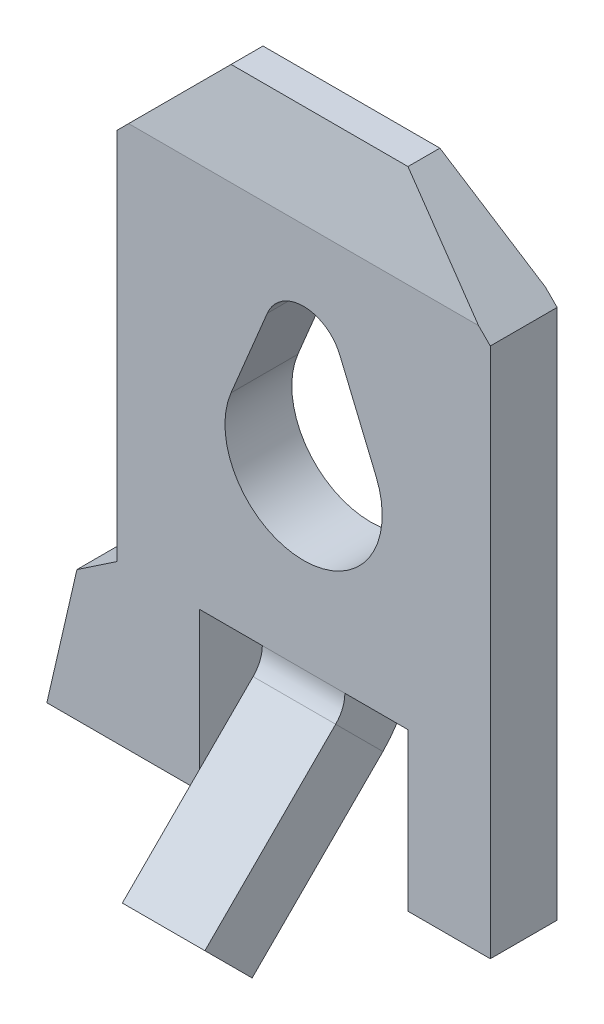
ISO-10303-21;
HEADER;
FILE_DESCRIPTION(('STEP AP214'),'2;1');
FILE_NAME('part.step','',(''),(''),'','','');
FILE_SCHEMA(('AUTOMOTIVE_DESIGN { 1 0 10303 214 1 1 1 1 }'));
ENDSEC;
DATA;
#1=APPLICATION_CONTEXT('core data for automotive mechanical design processes');
#2=APPLICATION_PROTOCOL_DEFINITION('international standard','automotive_design',2000,#1);
#3=PRODUCT_CONTEXT('',#1,'mechanical');
#4=PRODUCT('Part','Part','',(#3));
#5=PRODUCT_RELATED_PRODUCT_CATEGORY('part','',(#4));
#6=PRODUCT_DEFINITION_FORMATION('','',#4);
#7=PRODUCT_DEFINITION_CONTEXT('part definition',#1,'design');
#8=PRODUCT_DEFINITION('design','',#6,#7);
#9=PRODUCT_DEFINITION_SHAPE('','',#8);
#10=(LENGTH_UNIT() NAMED_UNIT(*) SI_UNIT(.MILLI.,.METRE.));
#11=(NAMED_UNIT(*) PLANE_ANGLE_UNIT() SI_UNIT($,.RADIAN.));
#12=(NAMED_UNIT(*) SI_UNIT($,.STERADIAN.) SOLID_ANGLE_UNIT());
#13=UNCERTAINTY_MEASURE_WITH_UNIT(LENGTH_MEASURE(1.E-05),#10,'distance_accuracy_value','');
#14=(GEOMETRIC_REPRESENTATION_CONTEXT(3) GLOBAL_UNCERTAINTY_ASSIGNED_CONTEXT((#13)) GLOBAL_UNIT_ASSIGNED_CONTEXT((#10,
#11,#12)) REPRESENTATION_CONTEXT('',''));
#15=CARTESIAN_POINT('',(0.,0.,0.));
#16=DIRECTION('',(0.,0.,1.));
#17=DIRECTION('',(1.,0.,0.));
#18=AXIS2_PLACEMENT_3D('',#15,#16,#17);
#19=CARTESIAN_POINT('',(4.75,0.149999999999999,0.));
#20=DIRECTION('',(0.,0.,1.));
#21=DIRECTION('',(0.,-1.,0.));
#22=AXIS2_PLACEMENT_3D('',#19,#20,#21);
#23=PLANE('',#22);
#24=DIRECTION('',(0.384813689288075,-0.922994271128755,0.));
#25=VECTOR('',#24,1.);
#26=CARTESIAN_POINT('',(2.84243697464802,5.82748992853653,0.));
#27=LINE('',#26,#25);
#28=CARTESIAN_POINT('',(2.84243697464802,5.82748992853653,0.));
#29=VERTEX_POINT('',#28);
#30=CARTESIAN_POINT('',(3.29799427112875,4.73481368928808,0.));
#31=VERTEX_POINT('',#30);
#32=EDGE_CURVE('E310',#29,#31,#27,.T.);
#33=ORIENTED_EDGE('',*,*,#32,.F.);
#34=CARTESIAN_POINT('',(2.375,5.65,0.));
#35=DIRECTION('',(0.,0.,1.));
#36=DIRECTION('',(0.,-1.,0.));
#37=AXIS2_PLACEMENT_3D('',#34,#35,#36);
#38=CIRCLE('',#37,0.5);
#39=CARTESIAN_POINT('',(1.91346153846154,5.84230769230769,0.));
#40=VERTEX_POINT('',#39);
#41=EDGE_CURVE('E313',#40,#29,#38,.F.);
#42=ORIENTED_EDGE('',*,*,#41,.F.);
#43=DIRECTION('',(0.384615384615385,0.923076923076923,0.));
#44=VECTOR('',#43,1.);
#45=CARTESIAN_POINT('',(1.91346153846154,5.84230769230769,0.));
#46=LINE('',#45,#44);
#47=CARTESIAN_POINT('',(1.45192307692308,4.73461538461538,0.));
#48=VERTEX_POINT('',#47);
#49=EDGE_CURVE('E315',#48,#40,#46,.T.);
#50=ORIENTED_EDGE('',*,*,#49,.F.);
#51=CARTESIAN_POINT('',(2.375,4.35,0.));
#52=DIRECTION('',(0.,0.,1.));
#53=DIRECTION('',(0.,-1.,0.));
#54=AXIS2_PLACEMENT_3D('',#51,#52,#53);
#55=CIRCLE('',#54,0.999999999999999);
#56=EDGE_CURVE('E307',#31,#48,#55,.F.);
#57=ORIENTED_EDGE('',*,*,#56,.F.);
#58=EDGE_LOOP('',(#33,#42,#50,#57));
#59=FACE_BOUND('',#58,.T.);
#60=DIRECTION('',(1.,0.,0.));
#61=VECTOR('',#60,1.);
#62=CARTESIAN_POINT('',(2.9,2.15,0.));
#63=LINE('',#62,#61);
#64=CARTESIAN_POINT('',(2.9,2.15,0.));
#65=VERTEX_POINT('',#64);
#66=CARTESIAN_POINT('',(3.7,2.15,0.));
#67=VERTEX_POINT('',#66);
#68=EDGE_CURVE('E274',#65,#67,#63,.T.);
#69=ORIENTED_EDGE('',*,*,#68,.F.);
#70=DIRECTION('',(-1.,0.,0.));
#71=VECTOR('',#70,1.);
#72=CARTESIAN_POINT('',(4.75,2.15,0.));
#73=LINE('',#72,#71);
#74=CARTESIAN_POINT('',(1.85000000000001,2.15,0.));
#75=VERTEX_POINT('',#74);
#76=EDGE_CURVE('E49',#65,#75,#73,.T.);
#77=ORIENTED_EDGE('',*,*,#76,.T.);
#78=DIRECTION('',(1.,0.,0.));
#79=VECTOR('',#78,1.);
#80=CARTESIAN_POINT('',(1.85,2.15,0.));
#81=LINE('',#80,#79);
#82=CARTESIAN_POINT('',(1.05,2.15,0.));
#83=VERTEX_POINT('',#82);
#84=EDGE_CURVE('E285',#83,#75,#81,.T.);
#85=ORIENTED_EDGE('',*,*,#84,.F.);
#86=DIRECTION('',(0.,1.,0.));
#87=VECTOR('',#86,1.);
#88=CARTESIAN_POINT('',(1.05,2.15,0.));
#89=LINE('',#88,#87);
#90=CARTESIAN_POINT('',(1.05,0.149999999999999,0.));
#91=VERTEX_POINT('',#90);
#92=EDGE_CURVE('E282',#91,#83,#89,.T.);
#93=ORIENTED_EDGE('',*,*,#92,.F.);
#94=DIRECTION('',(-1.,0.,0.));
#95=VECTOR('',#94,1.);
#96=CARTESIAN_POINT('',(4.75,0.149999999999999,0.));
#97=LINE('',#96,#95);
#98=CARTESIAN_POINT('',(-0.890356386047537,0.149999999999998,0.));
#99=VERTEX_POINT('',#98);
#100=EDGE_CURVE('E379',#91,#99,#97,.T.);
#101=ORIENTED_EDGE('',*,*,#100,.T.);
#102=DIRECTION('',(0.224692209858573,0.974429787531596,0.));
#103=VECTOR('',#102,1.);
#104=CARTESIAN_POINT('',(-0.507898340442458,1.80861785930754,0.));
#105=LINE('',#104,#103);
#106=CARTESIAN_POINT('',(-0.507898340442458,1.80861785930754,0.));
#107=VERTEX_POINT('',#106);
#108=EDGE_CURVE('E228',#99,#107,#105,.T.);
#109=ORIENTED_EDGE('',*,*,#108,.T.);
#110=DIRECTION('',(0.829945240760083,0.557844868525011,0.));
#111=VECTOR('',#110,1.);
#112=CARTESIAN_POINT('',(0.,2.15,0.));
#113=LINE('',#112,#111);
#114=CARTESIAN_POINT('',(0.,2.15,0.));
#115=VERTEX_POINT('',#114);
#116=EDGE_CURVE('E206',#107,#115,#113,.T.);
#117=ORIENTED_EDGE('',*,*,#116,.T.);
#118=DIRECTION('',(0.,1.,0.));
#119=VECTOR('',#118,1.);
#120=CARTESIAN_POINT('',(0.,0.149999999999999,0.));
#121=LINE('',#120,#119);
#122=CARTESIAN_POINT('',(0.,6.9,0.));
#123=VERTEX_POINT('',#122);
#124=EDGE_CURVE('E369',#115,#123,#121,.T.);
#125=ORIENTED_EDGE('',*,*,#124,.T.);
#126=DIRECTION('',(-0.707106781186548,-0.707106781186548,0.));
#127=VECTOR('',#126,1.);
#128=CARTESIAN_POINT('',(0.,6.9,0.));
#129=LINE('',#128,#127);
#130=CARTESIAN_POINT('',(0.15,7.05,0.));
#131=VERTEX_POINT('',#130);
#132=EDGE_CURVE('E343',#131,#123,#129,.T.);
#133=ORIENTED_EDGE('',*,*,#132,.F.);
#134=DIRECTION('',(-1.,0.,0.));
#135=VECTOR('',#134,1.);
#136=CARTESIAN_POINT('',(4.75,7.05,0.));
#137=LINE('',#136,#135);
#138=CARTESIAN_POINT('',(4.6,7.05,0.));
#139=VERTEX_POINT('',#138);
#140=EDGE_CURVE('E374',#139,#131,#137,.T.);
#141=ORIENTED_EDGE('',*,*,#140,.F.);
#142=DIRECTION('',(-0.707106781186548,0.707106781186548,0.));
#143=VECTOR('',#142,1.);
#144=CARTESIAN_POINT('',(3.5,8.15,0.));
#145=LINE('',#144,#143);
#146=CARTESIAN_POINT('',(4.75,6.9,0.));
#147=VERTEX_POINT('',#146);
#148=EDGE_CURVE('E339',#147,#139,#145,.T.);
#149=ORIENTED_EDGE('',*,*,#148,.F.);
#150=DIRECTION('',(0.,1.,0.));
#151=VECTOR('',#150,1.);
#152=CARTESIAN_POINT('',(4.75,0.149999999999999,0.));
#153=LINE('',#152,#151);
#154=CARTESIAN_POINT('',(4.75,0.149999999999999,0.));
#155=VERTEX_POINT('',#154);
#156=EDGE_CURVE('E371',#155,#147,#153,.T.);
#157=ORIENTED_EDGE('',*,*,#156,.F.);
#158=CARTESIAN_POINT('',(3.7,0.149999999999999,0.));
#159=VERTEX_POINT('',#158);
#160=EDGE_CURVE('E380',#155,#159,#97,.T.);
#161=ORIENTED_EDGE('',*,*,#160,.T.);
#162=DIRECTION('',(0.,-1.,0.));
#163=VECTOR('',#162,1.);
#164=CARTESIAN_POINT('',(3.7,2.15,0.));
#165=LINE('',#164,#163);
#166=EDGE_CURVE('E299',#67,#159,#165,.T.);
#167=ORIENTED_EDGE('',*,*,#166,.F.);
#168=EDGE_LOOP('',(#69,#77,#85,#93,#101,#109,#117,#125,#133,#141,#149,#157,#161,#167));
#169=FACE_BOUND('',#168,.T.);
#170=ADVANCED_FACE('F42',(#59,#169),#23,.F.);
#171=CARTESIAN_POINT('',(4.75,7.05,0.85));
#172=DIRECTION('',(0.,0.,-1.));
#173=DIRECTION('',(0.,1.,0.));
#174=AXIS2_PLACEMENT_3D('',#171,#172,#173);
#175=PLANE('',#174);
#176=DIRECTION('',(-0.384615384615385,-0.923076923076923,0.));
#177=VECTOR('',#176,1.);
#178=CARTESIAN_POINT('',(1.91346153846154,5.84230769230769,0.849999999999999));
#179=LINE('',#178,#177);
#180=CARTESIAN_POINT('',(1.91346153846154,5.84230769230769,0.85));
#181=VERTEX_POINT('',#180);
#182=CARTESIAN_POINT('',(1.45192307692308,4.73461538461538,0.849999999999999));
#183=VERTEX_POINT('',#182);
#184=EDGE_CURVE('E317',#181,#183,#179,.T.);
#185=ORIENTED_EDGE('',*,*,#184,.F.);
#186=CARTESIAN_POINT('',(2.375,5.65,0.849999999999999));
#187=DIRECTION('',(0.,0.,1.));
#188=DIRECTION('',(1.,0.,0.));
#189=AXIS2_PLACEMENT_3D('',#186,#187,#188);
#190=CIRCLE('',#189,0.5);
#191=CARTESIAN_POINT('',(2.84243697464802,5.82748992853653,0.849999999999999));
#192=VERTEX_POINT('',#191);
#193=EDGE_CURVE('E293',#192,#181,#190,.T.);
#194=ORIENTED_EDGE('',*,*,#193,.F.);
#195=DIRECTION('',(-0.384813689288075,0.922994271128755,0.));
#196=VECTOR('',#195,1.);
#197=CARTESIAN_POINT('',(2.84243697464802,5.82748992853653,0.849999999999999));
#198=LINE('',#197,#196);
#199=CARTESIAN_POINT('',(3.29799427112875,4.73481368928808,0.849999999999999));
#200=VERTEX_POINT('',#199);
#201=EDGE_CURVE('E323',#200,#192,#198,.T.);
#202=ORIENTED_EDGE('',*,*,#201,.F.);
#203=CARTESIAN_POINT('',(2.375,4.35,0.849999999999999));
#204=DIRECTION('',(0.,0.,1.));
#205=DIRECTION('',(1.,0.,0.));
#206=AXIS2_PLACEMENT_3D('',#203,#204,#205);
#207=CIRCLE('',#206,0.999999999999999);
#208=EDGE_CURVE('E320',#183,#200,#207,.T.);
#209=ORIENTED_EDGE('',*,*,#208,.F.);
#210=EDGE_LOOP('',(#185,#194,#202,#209));
#211=FACE_BOUND('',#210,.T.);
#212=DIRECTION('',(-1.,0.,0.));
#213=VECTOR('',#212,1.);
#214=CARTESIAN_POINT('',(1.85,2.15,0.85));
#215=LINE('',#214,#213);
#216=CARTESIAN_POINT('',(1.85000000000001,2.15,0.849999999999999));
#217=VERTEX_POINT('',#216);
#218=CARTESIAN_POINT('',(1.05,2.15,0.85));
#219=VERTEX_POINT('',#218);
#220=EDGE_CURVE('E278',#217,#219,#215,.T.);
#221=ORIENTED_EDGE('',*,*,#220,.F.);
#222=DIRECTION('',(1.,0.,0.));
#223=VECTOR('',#222,1.);
#224=CARTESIAN_POINT('',(4.75,2.15,0.849999999999999));
#225=LINE('',#224,#223);
#226=CARTESIAN_POINT('',(2.9,2.15,0.849999999999999));
#227=VERTEX_POINT('',#226);
#228=EDGE_CURVE('E396',#217,#227,#225,.T.);
#229=ORIENTED_EDGE('',*,*,#228,.T.);
#230=DIRECTION('',(-1.,0.,0.));
#231=VECTOR('',#230,1.);
#232=CARTESIAN_POINT('',(2.9,2.15,0.85));
#233=LINE('',#232,#231);
#234=CARTESIAN_POINT('',(3.7,2.15,0.85));
#235=VERTEX_POINT('',#234);
#236=EDGE_CURVE('E286',#235,#227,#233,.T.);
#237=ORIENTED_EDGE('',*,*,#236,.F.);
#238=DIRECTION('',(0.,1.,0.));
#239=VECTOR('',#238,1.);
#240=CARTESIAN_POINT('',(3.7,2.15,0.85));
#241=LINE('',#240,#239);
#242=CARTESIAN_POINT('',(3.7,0.149999999999999,0.849999999999999));
#243=VERTEX_POINT('',#242);
#244=EDGE_CURVE('E294',#243,#235,#241,.T.);
#245=ORIENTED_EDGE('',*,*,#244,.F.);
#246=DIRECTION('',(-1.,0.,0.));
#247=VECTOR('',#246,1.);
#248=CARTESIAN_POINT('',(4.75,0.149999999999999,0.849999999999999));
#249=LINE('',#248,#247);
#250=CARTESIAN_POINT('',(4.75,0.149999999999999,0.849999999999999));
#251=VERTEX_POINT('',#250);
#252=EDGE_CURVE('E384',#251,#243,#249,.T.);
#253=ORIENTED_EDGE('',*,*,#252,.F.);
#254=DIRECTION('',(0.,-1.,0.));
#255=VECTOR('',#254,1.);
#256=CARTESIAN_POINT('',(4.75,7.05,0.85));
#257=LINE('',#256,#255);
#258=CARTESIAN_POINT('',(4.75,6.9,0.85));
#259=VERTEX_POINT('',#258);
#260=EDGE_CURVE('E366',#259,#251,#257,.T.);
#261=ORIENTED_EDGE('',*,*,#260,.F.);
#262=DIRECTION('',(0.707106781186548,-0.707106781186548,0.));
#263=VECTOR('',#262,1.);
#264=CARTESIAN_POINT('',(3.5,8.15,0.849999999999999));
#265=LINE('',#264,#263);
#266=CARTESIAN_POINT('',(4.6,7.05,0.849999999999999));
#267=VERTEX_POINT('',#266);
#268=EDGE_CURVE('E335',#267,#259,#265,.T.);
#269=ORIENTED_EDGE('',*,*,#268,.F.);
#270=DIRECTION('',(-1.,0.,0.));
#271=VECTOR('',#270,1.);
#272=CARTESIAN_POINT('',(4.75,7.05,0.85));
#273=LINE('',#272,#271);
#274=CARTESIAN_POINT('',(0.15,7.05,0.849999999999999));
#275=VERTEX_POINT('',#274);
#276=EDGE_CURVE('E387',#267,#275,#273,.T.);
#277=ORIENTED_EDGE('',*,*,#276,.T.);
#278=DIRECTION('',(0.707106781186547,0.707106781186548,0.));
#279=VECTOR('',#278,1.);
#280=CARTESIAN_POINT('',(0.,6.9,0.849999999999999));
#281=LINE('',#280,#279);
#282=CARTESIAN_POINT('',(0.,6.9,0.849999999999999));
#283=VERTEX_POINT('',#282);
#284=EDGE_CURVE('E336',#283,#275,#281,.T.);
#285=ORIENTED_EDGE('',*,*,#284,.F.);
#286=DIRECTION('',(0.,-1.,0.));
#287=VECTOR('',#286,1.);
#288=CARTESIAN_POINT('',(0.,7.05,0.85));
#289=LINE('',#288,#287);
#290=CARTESIAN_POINT('',(0.,2.15,0.849999999999999));
#291=VERTEX_POINT('',#290);
#292=EDGE_CURVE('E225',#283,#291,#289,.T.);
#293=ORIENTED_EDGE('',*,*,#292,.T.);
#294=DIRECTION('',(-0.829945240760083,-0.557844868525011,0.));
#295=VECTOR('',#294,1.);
#296=CARTESIAN_POINT('',(0.,2.15,0.849999999999999));
#297=LINE('',#296,#295);
#298=CARTESIAN_POINT('',(-0.507898340442458,1.80861785930754,0.849999999999999));
#299=VERTEX_POINT('',#298);
#300=EDGE_CURVE('E56',#291,#299,#297,.T.);
#301=ORIENTED_EDGE('',*,*,#300,.T.);
#302=DIRECTION('',(-0.224692209858573,-0.974429787531596,0.));
#303=VECTOR('',#302,1.);
#304=CARTESIAN_POINT('',(-0.507898340442458,1.80861785930754,0.849999999999999));
#305=LINE('',#304,#303);
#306=CARTESIAN_POINT('',(-0.890356386047537,0.149999999999998,0.849999999999999));
#307=VERTEX_POINT('',#306);
#308=EDGE_CURVE('E214',#299,#307,#305,.T.);
#309=ORIENTED_EDGE('',*,*,#308,.T.);
#310=CARTESIAN_POINT('',(1.05,0.149999999999999,0.849999999999999));
#311=VERTEX_POINT('',#310);
#312=EDGE_CURVE('E383',#311,#307,#249,.T.);
#313=ORIENTED_EDGE('',*,*,#312,.F.);
#314=DIRECTION('',(0.,-1.,0.));
#315=VECTOR('',#314,1.);
#316=CARTESIAN_POINT('',(1.05,2.15,0.85));
#317=LINE('',#316,#315);
#318=EDGE_CURVE('E280',#219,#311,#317,.T.);
#319=ORIENTED_EDGE('',*,*,#318,.F.);
#320=EDGE_LOOP('',(#221,#229,#237,#245,#253,#261,#269,#277,#285,#293,#301,#309,#313,#319));
#321=FACE_BOUND('',#320,.T.);
#322=ADVANCED_FACE('F222',(#211,#321),#175,.F.);
#323=CARTESIAN_POINT('',(4.75,0.149999999999999,0.));
#324=DIRECTION('',(0.,1.,0.));
#325=DIRECTION('',(0.,0.,1.));
#326=AXIS2_PLACEMENT_3D('',#323,#324,#325);
#327=PLANE('',#326);
#328=ORIENTED_EDGE('',*,*,#100,.F.);
#329=DIRECTION('',(0.,0.,-1.));
#330=VECTOR('',#329,1.);
#331=CARTESIAN_POINT('',(1.05,0.149999999999999,3.0040659228538));
#332=LINE('',#331,#330);
#333=EDGE_CURVE('E289',#311,#91,#332,.T.);
#334=ORIENTED_EDGE('',*,*,#333,.F.);
#335=ORIENTED_EDGE('',*,*,#312,.T.);
#336=DIRECTION('',(0.,0.,1.));
#337=VECTOR('',#336,1.);
#338=CARTESIAN_POINT('',(-0.890356386047537,0.149999999999998,-2.18923148483107));
#339=LINE('',#338,#337);
#340=EDGE_CURVE('E209',#99,#307,#339,.T.);
#341=ORIENTED_EDGE('',*,*,#340,.F.);
#342=EDGE_LOOP('',(#328,#334,#335,#341));
#343=FACE_BOUND('',#342,.T.);
#344=ADVANCED_FACE('F454',(#343),#327,.F.);
#345=CARTESIAN_POINT('',(4.75,7.05,0.));
#346=DIRECTION('',(0.,-0.214348018272916,0.976757353216485));
#347=DIRECTION('',(0.,-0.976757353216485,-0.214348018272916));
#348=AXIS2_PLACEMENT_3D('',#345,#346,#347);
#349=PLANE('',#348);
#350=ORIENTED_EDGE('',*,*,#140,.T.);
#351=DIRECTION('',(0.698744344369524,0.698744344369524,0.153338457091523));
#352=VECTOR('',#351,1.);
#353=CARTESIAN_POINT('',(2.39592083042662,9.29592083042662,0.492864146468432));
#354=LINE('',#353,#352);
#355=CARTESIAN_POINT('',(1.25,8.15,0.241393442622949));
#356=VERTEX_POINT('',#355);
#357=EDGE_CURVE('E357',#131,#356,#354,.T.);
#358=ORIENTED_EDGE('',*,*,#357,.T.);
#359=DIRECTION('',(-1.,0.,0.));
#360=VECTOR('',#359,1.);
#361=CARTESIAN_POINT('',(4.75,8.15,0.241393442622949));
#362=LINE('',#361,#360);
#363=CARTESIAN_POINT('',(3.5,8.15,0.241393442622949));
#364=VERTEX_POINT('',#363);
#365=EDGE_CURVE('E393',#364,#356,#362,.T.);
#366=ORIENTED_EDGE('',*,*,#365,.F.);
#367=DIRECTION('',(0.698744344369524,-0.698744344369524,-0.153338457091523));
#368=VECTOR('',#367,1.);
#369=CARTESIAN_POINT('',(4.67323654881826,6.97676345118174,-0.0160716569500576));
#370=LINE('',#369,#368);
#371=EDGE_CURVE('E363',#364,#139,#370,.T.);
#372=ORIENTED_EDGE('',*,*,#371,.T.);
#373=EDGE_LOOP('',(#350,#358,#366,#372));
#374=FACE_BOUND('',#373,.T.);
#375=ADVANCED_FACE('F516',(#374),#349,.F.);
#376=CARTESIAN_POINT('',(4.75,8.15,0.241393442622949));
#377=DIRECTION('',(0.,-1.,0.));
#378=DIRECTION('',(0.,0.,-1.));
#379=AXIS2_PLACEMENT_3D('',#376,#377,#378);
#380=PLANE('',#379);
#381=ORIENTED_EDGE('',*,*,#365,.T.);
#382=DIRECTION('',(0.,0.,1.));
#383=VECTOR('',#382,1.);
#384=CARTESIAN_POINT('',(1.25,8.15,-1.76776695296637));
#385=LINE('',#384,#383);
#386=CARTESIAN_POINT('',(1.25,8.15,0.647131147540979));
#387=VERTEX_POINT('',#386);
#388=EDGE_CURVE('E340',#356,#387,#385,.T.);
#389=ORIENTED_EDGE('',*,*,#388,.T.);
#390=DIRECTION('',(-1.,0.,0.));
#391=VECTOR('',#390,1.);
#392=CARTESIAN_POINT('',(4.75,8.15,0.647131147540979));
#393=LINE('',#392,#391);
#394=CARTESIAN_POINT('',(3.5,8.15,0.647131147540979));
#395=VERTEX_POINT('',#394);
#396=EDGE_CURVE('E390',#395,#387,#393,.T.);
#397=ORIENTED_EDGE('',*,*,#396,.F.);
#398=DIRECTION('',(0.,0.,1.));
#399=VECTOR('',#398,1.);
#400=CARTESIAN_POINT('',(3.5,8.15,-1.76776695296637));
#401=LINE('',#400,#399);
#402=EDGE_CURVE('E349',#364,#395,#401,.T.);
#403=ORIENTED_EDGE('',*,*,#402,.F.);
#404=EDGE_LOOP('',(#381,#389,#397,#403));
#405=FACE_BOUND('',#404,.T.);
#406=ADVANCED_FACE('F512',(#405),#380,.F.);
#407=CARTESIAN_POINT('',(4.75,8.15,0.647131147540979));
#408=DIRECTION('',(0.,-0.181367589437408,-0.983415373838371));
#409=DIRECTION('',(0.,0.983415373838371,-0.181367589437408));
#410=AXIS2_PLACEMENT_3D('',#407,#408,#409);
#411=PLANE('',#410);
#412=ORIENTED_EDGE('',*,*,#396,.T.);
#413=DIRECTION('',(-0.70116968993079,-0.70116968993079,0.12931408215937));
#414=VECTOR('',#413,1.);
#415=CARTESIAN_POINT('',(2.97073626927174,9.87073626927174,0.329782245421185));
#416=LINE('',#415,#414);
#417=EDGE_CURVE('E347',#387,#275,#416,.T.);
#418=ORIENTED_EDGE('',*,*,#417,.T.);
#419=ORIENTED_EDGE('',*,*,#276,.F.);
#420=DIRECTION('',(-0.70116968993079,0.70116968993079,-0.12931408215937));
#421=VECTOR('',#420,1.);
#422=CARTESIAN_POINT('',(4.11454866759705,7.53545133240295,0.760470041155192));
#423=LINE('',#422,#421);
#424=EDGE_CURVE('E360',#267,#395,#423,.T.);
#425=ORIENTED_EDGE('',*,*,#424,.T.);
#426=EDGE_LOOP('',(#412,#418,#419,#425));
#427=FACE_BOUND('',#426,.T.);
#428=ADVANCED_FACE('F508',(#427),#411,.F.);
#429=ORIENTED_EDGE('',*,*,#252,.T.);
#430=DIRECTION('',(0.,0.,-1.));
#431=VECTOR('',#430,1.);
#432=CARTESIAN_POINT('',(3.7,0.149999999999999,3.0040659228538));
#433=LINE('',#432,#431);
#434=EDGE_CURVE('E296',#243,#159,#433,.T.);
#435=ORIENTED_EDGE('',*,*,#434,.T.);
#436=ORIENTED_EDGE('',*,*,#160,.F.);
#437=DIRECTION('',(0.,0.,-1.));
#438=VECTOR('',#437,1.);
#439=CARTESIAN_POINT('',(4.75,0.149999999999999,0.));
#440=LINE('',#439,#438);
#441=EDGE_CURVE('E368',#251,#155,#440,.T.);
#442=ORIENTED_EDGE('',*,*,#441,.F.);
#443=EDGE_LOOP('',(#429,#435,#436,#442));
#444=FACE_BOUND('',#443,.T.);
#445=ADVANCED_FACE('F501',(#444),#327,.F.);
#446=CARTESIAN_POINT('',(4.75,0.,0.));
#447=DIRECTION('',(1.,0.,0.));
#448=DIRECTION('',(0.,0.,-1.));
#449=AXIS2_PLACEMENT_3D('',#446,#447,#448);
#450=PLANE('',#449);
#451=DIRECTION('',(0.,0.,1.));
#452=VECTOR('',#451,1.);
#453=CARTESIAN_POINT('',(4.75,6.9,-1.76776695296637));
#454=LINE('',#453,#452);
#455=EDGE_CURVE('E350',#147,#259,#454,.T.);
#456=ORIENTED_EDGE('',*,*,#455,.T.);
#457=ORIENTED_EDGE('',*,*,#260,.T.);
#458=ORIENTED_EDGE('',*,*,#441,.T.);
#459=ORIENTED_EDGE('',*,*,#156,.T.);
#460=EDGE_LOOP('',(#456,#457,#458,#459));
#461=FACE_BOUND('',#460,.T.);
#462=ADVANCED_FACE('F498',(#461),#450,.T.);
#463=CARTESIAN_POINT('',(0.,0.,0.));
#464=DIRECTION('',(1.,0.,0.));
#465=DIRECTION('',(0.,0.,-1.));
#466=AXIS2_PLACEMENT_3D('',#463,#464,#465);
#467=PLANE('',#466);
#468=ORIENTED_EDGE('',*,*,#124,.F.);
#469=DIRECTION('',(0.,0.,1.));
#470=VECTOR('',#469,1.);
#471=CARTESIAN_POINT('',(0.,2.15,-2.18923148483107));
#472=LINE('',#471,#470);
#473=EDGE_CURVE('E210',#115,#291,#472,.T.);
#474=ORIENTED_EDGE('',*,*,#473,.T.);
#475=ORIENTED_EDGE('',*,*,#292,.F.);
#476=DIRECTION('',(0.,0.,1.));
#477=VECTOR('',#476,1.);
#478=CARTESIAN_POINT('',(0.,6.9,-1.76776695296637));
#479=LINE('',#478,#477);
#480=EDGE_CURVE('E338',#123,#283,#479,.T.);
#481=ORIENTED_EDGE('',*,*,#480,.F.);
#482=EDGE_LOOP('',(#468,#474,#475,#481));
#483=FACE_BOUND('',#482,.T.);
#484=ADVANCED_FACE('F493',(#483),#467,.F.);
#485=CARTESIAN_POINT('',(0.,6.9,-1.76776695296637));
#486=DIRECTION('',(0.707106781186548,-0.707106781186548,0.));
#487=DIRECTION('',(0.707106781186548,0.707106781186548,0.));
#488=AXIS2_PLACEMENT_3D('',#485,#486,#487);
#489=PLANE('',#488);
#490=ORIENTED_EDGE('',*,*,#132,.T.);
#491=ORIENTED_EDGE('',*,*,#480,.T.);
#492=ORIENTED_EDGE('',*,*,#284,.T.);
#493=ORIENTED_EDGE('',*,*,#417,.F.);
#494=ORIENTED_EDGE('',*,*,#388,.F.);
#495=ORIENTED_EDGE('',*,*,#357,.F.);
#496=EDGE_LOOP('',(#490,#491,#492,#493,#494,#495));
#497=FACE_BOUND('',#496,.T.);
#498=ADVANCED_FACE('F490',(#497),#489,.F.);
#499=CARTESIAN_POINT('',(3.5,8.15,-1.76776695296637));
#500=DIRECTION('',(-0.707106781186547,-0.707106781186547,0.));
#501=DIRECTION('',(0.707106781186548,-0.707106781186548,0.));
#502=AXIS2_PLACEMENT_3D('',#499,#500,#501);
#503=PLANE('',#502);
#504=ORIENTED_EDGE('',*,*,#402,.T.);
#505=ORIENTED_EDGE('',*,*,#424,.F.);
#506=ORIENTED_EDGE('',*,*,#268,.T.);
#507=ORIENTED_EDGE('',*,*,#455,.F.);
#508=ORIENTED_EDGE('',*,*,#148,.T.);
#509=ORIENTED_EDGE('',*,*,#371,.F.);
#510=EDGE_LOOP('',(#504,#505,#506,#507,#508,#509));
#511=FACE_BOUND('',#510,.T.);
#512=ADVANCED_FACE('F489',(#511),#503,.F.);
#513=CARTESIAN_POINT('',(2.375,5.65,-3.44093010681705));
#514=DIRECTION('',(0.,0.,1.));
#515=DIRECTION('',(1.,0.,0.));
#516=AXIS2_PLACEMENT_3D('',#513,#514,#515);
#517=CYLINDRICAL_SURFACE('',#516,0.5);
#518=ORIENTED_EDGE('',*,*,#41,.T.);
#519=DIRECTION('',(0.,0.,1.));
#520=VECTOR('',#519,1.);
#521=CARTESIAN_POINT('',(2.84243697464802,5.82748992853653,-3.44093010681705));
#522=LINE('',#521,#520);
#523=EDGE_CURVE('E311',#29,#192,#522,.T.);
#524=ORIENTED_EDGE('',*,*,#523,.T.);
#525=ORIENTED_EDGE('',*,*,#193,.T.);
#526=DIRECTION('',(0.,0.,1.));
#527=VECTOR('',#526,1.);
#528=CARTESIAN_POINT('',(1.91346153846154,5.84230769230769,-3.44093010681705));
#529=LINE('',#528,#527);
#530=EDGE_CURVE('E326',#40,#181,#529,.T.);
#531=ORIENTED_EDGE('',*,*,#530,.F.);
#532=EDGE_LOOP('',(#518,#524,#525,#531));
#533=FACE_BOUND('',#532,.T.);
#534=ADVANCED_FACE('F472',(#533),#517,.F.);
#535=CARTESIAN_POINT('',(2.84243697464802,5.82748992853653,-3.44093010681705));
#536=DIRECTION('',(0.922994271128755,0.384813689288075,0.));
#537=DIRECTION('',(-0.384813689288075,0.922994271128755,0.));
#538=AXIS2_PLACEMENT_3D('',#535,#536,#537);
#539=PLANE('',#538);
#540=ORIENTED_EDGE('',*,*,#32,.T.);
#541=DIRECTION('',(0.,0.,1.));
#542=VECTOR('',#541,1.);
#543=CARTESIAN_POINT('',(3.29799427112875,4.73481368928808,-3.44093010681705));
#544=LINE('',#543,#542);
#545=EDGE_CURVE('E328',#31,#200,#544,.T.);
#546=ORIENTED_EDGE('',*,*,#545,.T.);
#547=ORIENTED_EDGE('',*,*,#201,.T.);
#548=ORIENTED_EDGE('',*,*,#523,.F.);
#549=EDGE_LOOP('',(#540,#546,#547,#548));
#550=FACE_BOUND('',#549,.T.);
#551=ADVANCED_FACE('F463',(#550),#539,.F.);
#552=CARTESIAN_POINT('',(2.375,4.35,-3.44093010681705));
#553=DIRECTION('',(0.,0.,1.));
#554=DIRECTION('',(1.,0.,0.));
#555=AXIS2_PLACEMENT_3D('',#552,#553,#554);
#556=CYLINDRICAL_SURFACE('',#555,0.999999999999999);
#557=ORIENTED_EDGE('',*,*,#56,.T.);
#558=DIRECTION('',(0.,0.,1.));
#559=VECTOR('',#558,1.);
#560=CARTESIAN_POINT('',(1.45192307692308,4.73461538461538,-3.44093010681705));
#561=LINE('',#560,#559);
#562=EDGE_CURVE('E330',#48,#183,#561,.T.);
#563=ORIENTED_EDGE('',*,*,#562,.T.);
#564=ORIENTED_EDGE('',*,*,#208,.T.);
#565=ORIENTED_EDGE('',*,*,#545,.F.);
#566=EDGE_LOOP('',(#557,#563,#564,#565));
#567=FACE_BOUND('',#566,.T.);
#568=ADVANCED_FACE('F465',(#567),#556,.F.);
#569=CARTESIAN_POINT('',(1.91346153846154,5.84230769230769,-3.44093010681705));
#570=DIRECTION('',(-0.923076923076923,0.384615384615385,0.));
#571=DIRECTION('',(-0.384615384615385,-0.923076923076923,0.));
#572=AXIS2_PLACEMENT_3D('',#569,#570,#571);
#573=PLANE('',#572);
#574=ORIENTED_EDGE('',*,*,#49,.T.);
#575=ORIENTED_EDGE('',*,*,#530,.T.);
#576=ORIENTED_EDGE('',*,*,#184,.T.);
#577=ORIENTED_EDGE('',*,*,#562,.F.);
#578=EDGE_LOOP('',(#574,#575,#576,#577));
#579=FACE_BOUND('',#578,.T.);
#580=ADVANCED_FACE('F474',(#579),#573,.F.);
#581=CARTESIAN_POINT('',(3.7,2.15,3.0040659228538));
#582=DIRECTION('',(1.,0.,0.));
#583=DIRECTION('',(0.,1.,0.));
#584=AXIS2_PLACEMENT_3D('',#581,#582,#583);
#585=PLANE('',#584);
#586=ORIENTED_EDGE('',*,*,#244,.T.);
#587=DIRECTION('',(0.,0.,-1.));
#588=VECTOR('',#587,1.);
#589=CARTESIAN_POINT('',(3.7,2.15,3.0040659228538));
#590=LINE('',#589,#588);
#591=EDGE_CURVE('E301',#235,#67,#590,.T.);
#592=ORIENTED_EDGE('',*,*,#591,.T.);
#593=ORIENTED_EDGE('',*,*,#166,.T.);
#594=ORIENTED_EDGE('',*,*,#434,.F.);
#595=EDGE_LOOP('',(#586,#592,#593,#594));
#596=FACE_BOUND('',#595,.T.);
#597=ADVANCED_FACE('F476',(#596),#585,.F.);
#598=CARTESIAN_POINT('',(2.9,2.15,3.0040659228538));
#599=DIRECTION('',(0.,1.,0.));
#600=DIRECTION('',(-1.,0.,0.));
#601=AXIS2_PLACEMENT_3D('',#598,#599,#600);
#602=PLANE('',#601);
#603=ORIENTED_EDGE('',*,*,#236,.T.);
#604=DIRECTION('',(0.,0.,-1.));
#605=VECTOR('',#604,1.);
#606=CARTESIAN_POINT('',(2.9,2.15,3.0040659228538));
#607=LINE('',#606,#605);
#608=EDGE_CURVE('E12',#227,#65,#607,.T.);
#609=ORIENTED_EDGE('',*,*,#608,.T.);
#610=ORIENTED_EDGE('',*,*,#68,.T.);
#611=ORIENTED_EDGE('',*,*,#591,.F.);
#612=EDGE_LOOP('',(#603,#609,#610,#611));
#613=FACE_BOUND('',#612,.T.);
#614=ADVANCED_FACE('F407',(#613),#602,.F.);
#615=CARTESIAN_POINT('',(1.85,2.15,3.0040659228538));
#616=DIRECTION('',(0.,1.,0.));
#617=DIRECTION('',(0.,0.,1.));
#618=AXIS2_PLACEMENT_3D('',#615,#616,#617);
#619=PLANE('',#618);
#620=ORIENTED_EDGE('',*,*,#220,.T.);
#621=DIRECTION('',(0.,0.,-1.));
#622=VECTOR('',#621,1.);
#623=CARTESIAN_POINT('',(1.05,2.15,3.0040659228538));
#624=LINE('',#623,#622);
#625=EDGE_CURVE('E281',#219,#83,#624,.T.);
#626=ORIENTED_EDGE('',*,*,#625,.T.);
#627=ORIENTED_EDGE('',*,*,#84,.T.);
#628=DIRECTION('',(0.,0.,-1.));
#629=VECTOR('',#628,1.);
#630=CARTESIAN_POINT('',(1.85,2.15,3.0040659228538));
#631=LINE('',#630,#629);
#632=EDGE_CURVE('E399',#217,#75,#631,.T.);
#633=ORIENTED_EDGE('',*,*,#632,.F.);
#634=EDGE_LOOP('',(#620,#626,#627,#633));
#635=FACE_BOUND('',#634,.T.);
#636=ADVANCED_FACE('F420',(#635),#619,.F.);
#637=CARTESIAN_POINT('',(1.05,2.15,3.0040659228538));
#638=DIRECTION('',(-1.,0.,0.));
#639=DIRECTION('',(0.,-1.,0.));
#640=AXIS2_PLACEMENT_3D('',#637,#638,#639);
#641=PLANE('',#640);
#642=ORIENTED_EDGE('',*,*,#318,.T.);
#643=ORIENTED_EDGE('',*,*,#333,.T.);
#644=ORIENTED_EDGE('',*,*,#92,.T.);
#645=ORIENTED_EDGE('',*,*,#625,.F.);
#646=EDGE_LOOP('',(#642,#643,#644,#645));
#647=FACE_BOUND('',#646,.T.);
#648=ADVANCED_FACE('F542',(#647),#641,.F.);
#649=CARTESIAN_POINT('',(1.85,2.15,1.25));
#650=DIRECTION('',(1.,0.,0.));
#651=DIRECTION('',(0.,1.,0.));
#652=AXIS2_PLACEMENT_3D('',#649,#650,#651);
#653=PLANE('',#652);
#654=ORIENTED_EDGE('',*,*,#632,.T.);
#655=CARTESIAN_POINT('',(1.85000000000001,2.15,1.25));
#656=DIRECTION('',(1.,0.,0.));
#657=DIRECTION('',(0.,1.,0.));
#658=AXIS2_PLACEMENT_3D('',#655,#656,#657);
#659=CIRCLE('',#658,1.25);
#660=CARTESIAN_POINT('',(1.85,1.26611652351682,0.366116523516817));
#661=VERTEX_POINT('',#660);
#662=EDGE_CURVE('E236',#75,#661,#659,.F.);
#663=ORIENTED_EDGE('',*,*,#662,.T.);
#664=DIRECTION('',(0.,0.707106781186544,0.707106781186551));
#665=VECTOR('',#664,1.);
#666=CARTESIAN_POINT('',(1.85,3.39031190869815,2.49031190869817));
#667=LINE('',#666,#665);
#668=CARTESIAN_POINT('',(1.85,1.86715728752538,0.967157287525381));
#669=VERTEX_POINT('',#668);
#670=EDGE_CURVE('E256',#661,#669,#667,.T.);
#671=ORIENTED_EDGE('',*,*,#670,.T.);
#672=CARTESIAN_POINT('',(1.85,2.15,1.25));
#673=DIRECTION('',(-1.,0.,0.));
#674=DIRECTION('',(0.,1.,0.));
#675=AXIS2_PLACEMENT_3D('',#672,#673,#674);
#676=CIRCLE('',#675,0.4);
#677=EDGE_CURVE('E267',#217,#669,#676,.T.);
#678=ORIENTED_EDGE('',*,*,#677,.F.);
#679=EDGE_LOOP('',(#654,#663,#671,#678));
#680=FACE_BOUND('',#679,.T.);
#681=ADVANCED_FACE('F422',(#680),#653,.F.);
#682=CARTESIAN_POINT('',(2.9,2.15,1.25));
#683=DIRECTION('',(-1.,0.,0.));
#684=DIRECTION('',(0.,0.,1.));
#685=AXIS2_PLACEMENT_3D('',#682,#683,#684);
#686=PLANE('',#685);
#687=DIRECTION('',(0.,-0.707106781186544,-0.707106781186551));
#688=VECTOR('',#687,1.);
#689=CARTESIAN_POINT('',(2.9,3.39031190869815,2.49031190869817));
#690=LINE('',#689,#688);
#691=CARTESIAN_POINT('',(2.9,1.86715728752538,0.96715728752538));
#692=VERTEX_POINT('',#691);
#693=CARTESIAN_POINT('',(2.9,1.26611652351682,0.366116523516817));
#694=VERTEX_POINT('',#693);
#695=EDGE_CURVE('E262',#692,#694,#690,.T.);
#696=ORIENTED_EDGE('',*,*,#695,.T.);
#697=CARTESIAN_POINT('',(2.9,2.15,1.25));
#698=DIRECTION('',(1.,0.,0.));
#699=DIRECTION('',(0.,1.,0.));
#700=AXIS2_PLACEMENT_3D('',#697,#698,#699);
#701=CIRCLE('',#700,1.25);
#702=EDGE_CURVE('E271',#694,#65,#701,.T.);
#703=ORIENTED_EDGE('',*,*,#702,.T.);
#704=ORIENTED_EDGE('',*,*,#608,.F.);
#705=CARTESIAN_POINT('',(2.9,2.15,1.25));
#706=DIRECTION('',(1.,0.,0.));
#707=DIRECTION('',(0.,0.,1.));
#708=AXIS2_PLACEMENT_3D('',#705,#706,#707);
#709=CIRCLE('',#708,0.4);
#710=EDGE_CURVE('E270',#692,#227,#709,.T.);
#711=ORIENTED_EDGE('',*,*,#710,.F.);
#712=EDGE_LOOP('',(#696,#703,#704,#711));
#713=FACE_BOUND('',#712,.T.);
#714=ADVANCED_FACE('F411',(#713),#686,.F.);
#715=CARTESIAN_POINT('',(0.876719746353102,2.15,1.25));
#716=DIRECTION('',(1.,0.,0.));
#717=DIRECTION('',(0.,1.,0.));
#718=AXIS2_PLACEMENT_3D('',#715,#716,#717);
#719=CYLINDRICAL_SURFACE('',#718,0.4);
#720=ORIENTED_EDGE('',*,*,#710,.T.);
#721=ORIENTED_EDGE('',*,*,#228,.F.);
#722=ORIENTED_EDGE('',*,*,#677,.T.);
#723=DIRECTION('',(1.,0.,0.));
#724=VECTOR('',#723,1.);
#725=CARTESIAN_POINT('',(4.75,1.86715728752538,0.967157287525383));
#726=LINE('',#725,#724);
#727=EDGE_CURVE('E233',#669,#692,#726,.T.);
#728=ORIENTED_EDGE('',*,*,#727,.T.);
#729=EDGE_LOOP('',(#720,#721,#722,#728));
#730=FACE_BOUND('',#729,.T.);
#731=ADVANCED_FACE('F414',(#730),#719,.F.);
#732=CARTESIAN_POINT('',(0.876719746353102,2.15,1.25));
#733=DIRECTION('',(1.,0.,0.));
#734=DIRECTION('',(0.,1.,0.));
#735=AXIS2_PLACEMENT_3D('',#732,#733,#734);
#736=CYLINDRICAL_SURFACE('',#735,1.25);
#737=ORIENTED_EDGE('',*,*,#702,.F.);
#738=DIRECTION('',(-1.,0.,0.));
#739=VECTOR('',#738,1.);
#740=CARTESIAN_POINT('',(4.75,1.26611652351682,0.366116523516814));
#741=LINE('',#740,#739);
#742=EDGE_CURVE('E259',#694,#661,#741,.T.);
#743=ORIENTED_EDGE('',*,*,#742,.T.);
#744=ORIENTED_EDGE('',*,*,#662,.F.);
#745=ORIENTED_EDGE('',*,*,#76,.F.);
#746=EDGE_LOOP('',(#737,#743,#744,#745));
#747=FACE_BOUND('',#746,.T.);
#748=ADVANCED_FACE('F423',(#747),#736,.T.);
#749=CARTESIAN_POINT('',(0.,-0.397031517045243,2.02926456407888));
#750=DIRECTION('',(0.,-0.707106781186546,0.707106781186549));
#751=DIRECTION('',(0.,-0.707106781186549,-0.707106781186546));
#752=AXIS2_PLACEMENT_3D('',#749,#750,#751);
#753=PLANE('',#752);
#754=DIRECTION('',(0.,0.707106781186549,0.707106781186546));
#755=VECTOR('',#754,1.);
#756=CARTESIAN_POINT('',(2.9,-0.397031517045244,2.02926456407888));
#757=LINE('',#756,#755);
#758=CARTESIAN_POINT('',(2.9,-0.397031517045244,2.02926456407888));
#759=VERTEX_POINT('',#758);
#760=CARTESIAN_POINT('',(2.9,0.204009246963322,2.63030532808745));
#761=VERTEX_POINT('',#760);
#762=EDGE_CURVE('E253',#759,#761,#757,.T.);
#763=ORIENTED_EDGE('',*,*,#762,.T.);
#764=DIRECTION('',(-1.,0.,0.));
#765=VECTOR('',#764,1.);
#766=CARTESIAN_POINT('',(2.9,0.204009246963322,2.63030532808745));
#767=LINE('',#766,#765);
#768=CARTESIAN_POINT('',(1.85,0.204009246963323,2.63030532808745));
#769=VERTEX_POINT('',#768);
#770=EDGE_CURVE('E250',#761,#769,#767,.T.);
#771=ORIENTED_EDGE('',*,*,#770,.T.);
#772=DIRECTION('',(0.,-0.707106781186549,-0.707106781186546));
#773=VECTOR('',#772,1.);
#774=CARTESIAN_POINT('',(1.85,0.204009246963323,2.63030532808745));
#775=LINE('',#774,#773);
#776=CARTESIAN_POINT('',(1.85,-0.397031517045243,2.02926456407888));
#777=VERTEX_POINT('',#776);
#778=EDGE_CURVE('E247',#769,#777,#775,.T.);
#779=ORIENTED_EDGE('',*,*,#778,.T.);
#780=DIRECTION('',(1.,0.,0.));
#781=VECTOR('',#780,1.);
#782=CARTESIAN_POINT('',(1.85,-0.397031517045243,2.02926456407888));
#783=LINE('',#782,#781);
#784=EDGE_CURVE('E244',#777,#759,#783,.T.);
#785=ORIENTED_EDGE('',*,*,#784,.T.);
#786=EDGE_LOOP('',(#763,#771,#779,#785));
#787=FACE_BOUND('',#786,.T.);
#788=ADVANCED_FACE('F438',(#787),#753,.T.);
#789=CARTESIAN_POINT('',(4.75,5.79015281833704,-2.95583824328629));
#790=DIRECTION('',(0.,-0.707106781186549,-0.707106781186546));
#791=DIRECTION('',(0.,0.707106781186546,-0.707106781186549));
#792=AXIS2_PLACEMENT_3D('',#789,#790,#791);
#793=PLANE('',#792);
#794=ORIENTED_EDGE('',*,*,#727,.F.);
#795=DIRECTION('',(0.,0.707106781186546,-0.707106781186549));
#796=VECTOR('',#795,1.);
#797=CARTESIAN_POINT('',(1.85,2.32532959052296,0.508984984527799));
#798=LINE('',#797,#796);
#799=EDGE_CURVE('E239',#769,#669,#798,.T.);
#800=ORIENTED_EDGE('',*,*,#799,.F.);
#801=ORIENTED_EDGE('',*,*,#770,.F.);
#802=DIRECTION('',(0.,-0.707106781186546,0.707106781186549));
#803=VECTOR('',#802,1.);
#804=CARTESIAN_POINT('',(2.9,2.32532959052296,0.508984984527799));
#805=LINE('',#804,#803);
#806=EDGE_CURVE('E237',#692,#761,#805,.T.);
#807=ORIENTED_EDGE('',*,*,#806,.F.);
#808=EDGE_LOOP('',(#794,#800,#801,#807));
#809=FACE_BOUND('',#808,.T.);
#810=ADVANCED_FACE('F435',(#809),#793,.F.);
#811=CARTESIAN_POINT('',(1.85,3.84848421169575,2.03213960570058));
#812=DIRECTION('',(1.,0.,0.));
#813=DIRECTION('',(0.,-0.707106781186549,-0.707106781186546));
#814=AXIS2_PLACEMENT_3D('',#811,#812,#813);
#815=PLANE('',#814);
#816=ORIENTED_EDGE('',*,*,#670,.F.);
#817=DIRECTION('',(0.,-0.707106781186546,0.707106781186549));
#818=VECTOR('',#817,1.);
#819=CARTESIAN_POINT('',(1.85,1.7242888265144,-0.0920557794807644));
#820=LINE('',#819,#818);
#821=EDGE_CURVE('E242',#661,#777,#820,.T.);
#822=ORIENTED_EDGE('',*,*,#821,.T.);
#823=ORIENTED_EDGE('',*,*,#778,.F.);
#824=ORIENTED_EDGE('',*,*,#799,.T.);
#825=EDGE_LOOP('',(#816,#822,#823,#824));
#826=FACE_BOUND('',#825,.T.);
#827=ADVANCED_FACE('F440',(#826),#815,.F.);
#828=CARTESIAN_POINT('',(4.75,0.310075264141302,1.32215778289233));
#829=DIRECTION('',(0.,0.707106781186549,0.707106781186546));
#830=DIRECTION('',(0.,-0.707106781186546,0.707106781186549));
#831=AXIS2_PLACEMENT_3D('',#828,#829,#830);
#832=PLANE('',#831);
#833=ORIENTED_EDGE('',*,*,#742,.F.);
#834=DIRECTION('',(0.,0.707106781186546,-0.707106781186549));
#835=VECTOR('',#834,1.);
#836=CARTESIAN_POINT('',(2.9,1.7242888265144,-0.0920557794807646));
#837=LINE('',#836,#835);
#838=EDGE_CURVE('E234',#759,#694,#837,.T.);
#839=ORIENTED_EDGE('',*,*,#838,.F.);
#840=ORIENTED_EDGE('',*,*,#784,.F.);
#841=ORIENTED_EDGE('',*,*,#821,.F.);
#842=EDGE_LOOP('',(#833,#839,#840,#841));
#843=FACE_BOUND('',#842,.T.);
#844=ADVANCED_FACE('F426',(#843),#832,.F.);
#845=CARTESIAN_POINT('',(2.9,3.84848421169575,2.03213960570058));
#846=DIRECTION('',(-1.,0.,0.));
#847=DIRECTION('',(0.,-0.707106781186546,0.707106781186549));
#848=AXIS2_PLACEMENT_3D('',#845,#846,#847);
#849=PLANE('',#848);
#850=ORIENTED_EDGE('',*,*,#695,.F.);
#851=ORIENTED_EDGE('',*,*,#806,.T.);
#852=ORIENTED_EDGE('',*,*,#762,.F.);
#853=ORIENTED_EDGE('',*,*,#838,.T.);
#854=EDGE_LOOP('',(#850,#851,#852,#853));
#855=FACE_BOUND('',#854,.T.);
#856=ADVANCED_FACE('F431',(#855),#849,.F.);
#857=CARTESIAN_POINT('',(-0.507898340442458,1.80861785930754,-2.18923148483107));
#858=DIRECTION('',(-0.974429787531596,0.224692209858573,0.));
#859=DIRECTION('',(-0.224692209858573,-0.974429787531596,0.));
#860=AXIS2_PLACEMENT_3D('',#857,#858,#859);
#861=PLANE('',#860);
#862=ORIENTED_EDGE('',*,*,#108,.F.);
#863=ORIENTED_EDGE('',*,*,#340,.T.);
#864=ORIENTED_EDGE('',*,*,#308,.F.);
#865=DIRECTION('',(0.,0.,1.));
#866=VECTOR('',#865,1.);
#867=CARTESIAN_POINT('',(-0.507898340442458,1.80861785930754,-2.18923148483107));
#868=LINE('',#867,#866);
#869=EDGE_CURVE('E203',#107,#299,#868,.T.);
#870=ORIENTED_EDGE('',*,*,#869,.F.);
#871=EDGE_LOOP('',(#862,#863,#864,#870));
#872=FACE_BOUND('',#871,.T.);
#873=ADVANCED_FACE('F215',(#872),#861,.T.);
#874=CARTESIAN_POINT('',(0.,2.15,-2.18923148483107));
#875=DIRECTION('',(-0.557844868525011,0.829945240760083,0.));
#876=DIRECTION('',(-0.829945240760083,-0.557844868525011,0.));
#877=AXIS2_PLACEMENT_3D('',#874,#875,#876);
#878=PLANE('',#877);
#879=ORIENTED_EDGE('',*,*,#116,.F.);
#880=ORIENTED_EDGE('',*,*,#869,.T.);
#881=ORIENTED_EDGE('',*,*,#300,.F.);
#882=ORIENTED_EDGE('',*,*,#473,.F.);
#883=EDGE_LOOP('',(#879,#880,#881,#882));
#884=FACE_BOUND('',#883,.T.);
#885=ADVANCED_FACE('F205',(#884),#878,.T.);
#886=CLOSED_SHELL('',(#170,#322,#344,#375,#406,#428,#445,#462,#484,#498,#512,#534,#551,#568,
#580,#597,#614,#636,#648,#681,#714,#731,#748,#788,#810,#827,#844,#856,#873,#885));
#887=MANIFOLD_SOLID_BREP('B2',#886);
#888=ADVANCED_BREP_SHAPE_REPRESENTATION('',(#18,#887),#14);
#889=SHAPE_DEFINITION_REPRESENTATION(#9,#888);
ENDSEC;
END-ISO-10303-21;
